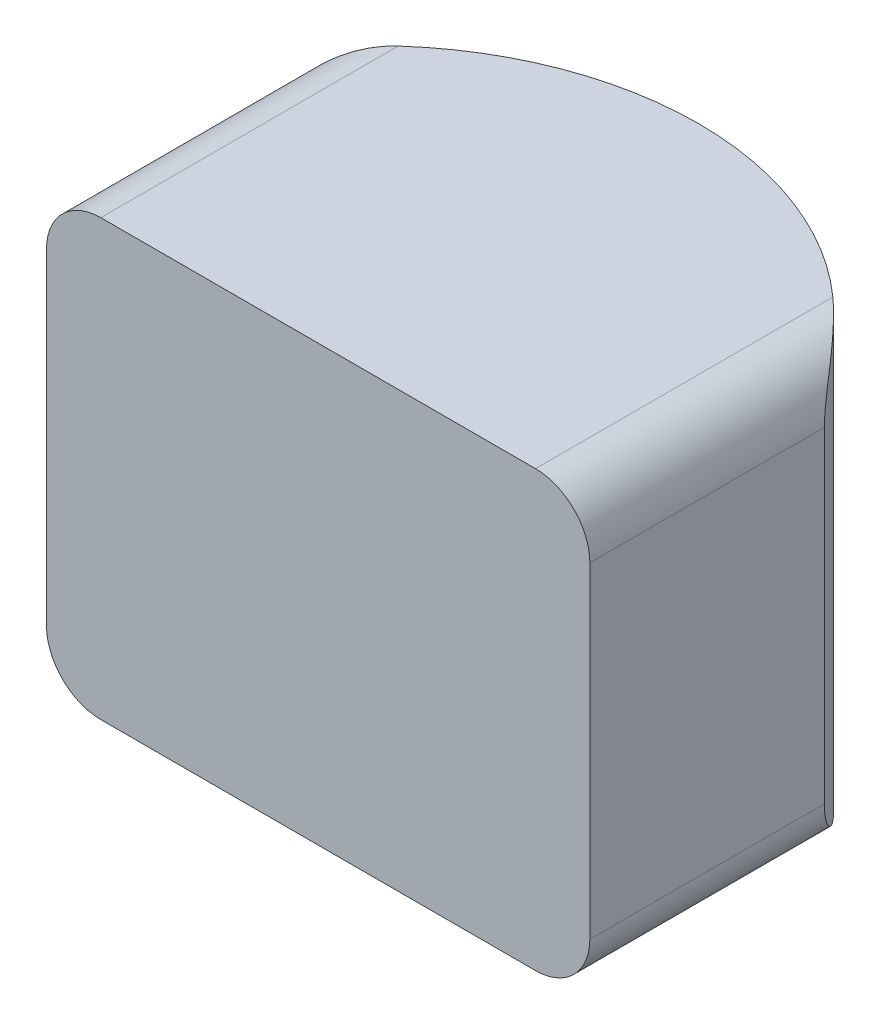
ISO-10303-21;
HEADER;
FILE_DESCRIPTION(('STEP AP214'),'2;1');
FILE_NAME('part.step','',(''),(''),'','','');
FILE_SCHEMA(('AUTOMOTIVE_DESIGN { 1 0 10303 214 1 1 1 1 }'));
ENDSEC;
DATA;
#1=APPLICATION_CONTEXT('core data for automotive mechanical design processes');
#2=APPLICATION_PROTOCOL_DEFINITION('international standard','automotive_design',2000,#1);
#3=PRODUCT_CONTEXT('',#1,'mechanical');
#4=PRODUCT('Part','Part','',(#3));
#5=PRODUCT_RELATED_PRODUCT_CATEGORY('part','',(#4));
#6=PRODUCT_DEFINITION_FORMATION('','',#4);
#7=PRODUCT_DEFINITION_CONTEXT('part definition',#1,'design');
#8=PRODUCT_DEFINITION('design','',#6,#7);
#9=PRODUCT_DEFINITION_SHAPE('','',#8);
#10=(LENGTH_UNIT() NAMED_UNIT(*) SI_UNIT(.MILLI.,.METRE.));
#11=(NAMED_UNIT(*) PLANE_ANGLE_UNIT() SI_UNIT($,.RADIAN.));
#12=(NAMED_UNIT(*) SI_UNIT($,.STERADIAN.) SOLID_ANGLE_UNIT());
#13=UNCERTAINTY_MEASURE_WITH_UNIT(LENGTH_MEASURE(1.E-05),#10,'distance_accuracy_value','');
#14=(GEOMETRIC_REPRESENTATION_CONTEXT(3) GLOBAL_UNCERTAINTY_ASSIGNED_CONTEXT((#13)) GLOBAL_UNIT_ASSIGNED_CONTEXT((#10,
#11,#12)) REPRESENTATION_CONTEXT('',''));
#15=CARTESIAN_POINT('',(0.,0.,0.));
#16=DIRECTION('',(0.,0.,1.));
#17=DIRECTION('',(1.,0.,0.));
#18=AXIS2_PLACEMENT_3D('',#15,#16,#17);
#19=CARTESIAN_POINT('',(4.,3.,-1.));
#20=DIRECTION('',(0.,0.,1.));
#21=DIRECTION('',(1.,0.,0.));
#22=AXIS2_PLACEMENT_3D('',#19,#20,#21);
#23=CYLINDRICAL_SURFACE('',#22,1.);
#24=CARTESIAN_POINT('',(4.,3.,0.));
#25=DIRECTION('',(0.,0.,1.));
#26=DIRECTION('',(-1.,0.,0.));
#27=AXIS2_PLACEMENT_3D('',#24,#25,#26);
#28=CIRCLE('',#27,1.);
#29=CARTESIAN_POINT('',(5.,2.99999999999999,0.));
#30=VERTEX_POINT('',#29);
#31=CARTESIAN_POINT('',(3.99999999999999,4.,0.));
#32=VERTEX_POINT('',#31);
#33=EDGE_CURVE('E236',#30,#32,#28,.T.);
#34=ORIENTED_EDGE('',*,*,#33,.F.);
#35=DIRECTION('',(0.,0.,1.));
#36=VECTOR('',#35,1.);
#37=CARTESIAN_POINT('',(5.,2.99999999999999,-1.));
#38=LINE('',#37,#36);
#39=CARTESIAN_POINT('',(5.,2.99999999999999,-4.31662479591225));
#40=VERTEX_POINT('',#39);
#41=EDGE_CURVE('E76',#40,#30,#38,.T.);
#42=ORIENTED_EDGE('',*,*,#41,.F.);
#43=CARTESIAN_POINT('',(3.99999999999999,4.,-5.47213597416036));
#44=CARTESIAN_POINT('',(4.03897853662187,3.99998939930265,-5.43728007247443));
#45=CARTESIAN_POINT('',(4.07747515593375,3.99772163288366,-5.40192309489688));
#46=CARTESIAN_POINT('',(4.15326103898565,3.98892398405111,-5.33048678692282));
#47=CARTESIAN_POINT('',(4.19055089667703,3.98239623288944,-5.29440782647567));
#48=CARTESIAN_POINT('',(4.26406731999918,3.96524911208241,-5.2214263474312));
#49=CARTESIAN_POINT('',(4.30028038915442,3.95459139450479,-5.18451925884733));
#50=CARTESIAN_POINT('',(4.37108071262617,3.92936037553928,-5.1105092027966));
#51=CARTESIAN_POINT('',(4.40566776632959,3.91478659248038,-5.07340621178471));
#52=CARTESIAN_POINT('',(4.50737451051804,3.86505194258381,-4.96153027574397));
#53=CARTESIAN_POINT('',(4.57184817961045,3.82401763353102,-4.88678093152144));
#54=CARTESIAN_POINT('',(4.66181793432333,3.75065411839832,-4.77752562030059));
#55=CARTESIAN_POINT('',(4.69064511891303,3.72428064380254,-4.74163842607548));
#56=CARTESIAN_POINT('',(4.74583920257688,3.66730578739845,-4.6713747270137));
#57=CARTESIAN_POINT('',(4.77220851950526,3.63670863563552,-4.63699675552281));
#58=CARTESIAN_POINT('',(4.82016122348758,3.57340229011556,-4.57316638988878));
#59=CARTESIAN_POINT('',(4.84195632293938,3.54103290735551,-4.54353833758051));
#60=CARTESIAN_POINT('',(4.88254621232647,3.47192859661895,-4.48739692691413));
#61=CARTESIAN_POINT('',(4.9013421671037,3.43519537323828,-4.46088236036682));
#62=CARTESIAN_POINT('',(4.93219866619862,3.36366669017885,-4.41672611139059));
#63=CARTESIAN_POINT('',(4.94486084622406,3.32959802194395,-4.39834224399799));
#64=CARTESIAN_POINT('',(4.96675614467246,3.2583820212921,-4.36626039107637));
#65=CARTESIAN_POINT('',(4.97600307665197,3.22124785102942,-4.35254354712373));
#66=CARTESIAN_POINT('',(4.98858682035538,3.15355298744279,-4.3337822844375));
#67=CARTESIAN_POINT('',(4.99280457266535,3.12351752495978,-4.32745348402442));
#68=CARTESIAN_POINT('',(4.9985397211296,3.06235419238754,-4.31882660628717));
#69=CARTESIAN_POINT('',(5.00003243388851,3.03121891584626,-4.31656537565711));
#70=CARTESIAN_POINT('',(5.,2.99999999999999,-4.31662479591225));
#71=B_SPLINE_CURVE_WITH_KNOTS('',3,(#43,#44,#45,#46,#47,#48,#49,#50,#51,#52,#53,#54,#55,#56,#57,
#58,#59,#60,#61,#62,#63,#64,#65,#66,#67,#68,#69,#70),.UNSPECIFIED.,.F.,.F.,(4,2,2,2,2,2,2,2,2,2,
2,2,2,4),(0.,0.156779652430063,0.313480928749503,0.471673501059475,0.629885539765111,
0.948826283264332,1.10780724125314,1.2666301183996,1.41332228273772,1.55995733369052,
1.68173930965045,1.80302317869529,1.89559187586748,1.98899497671797),.UNSPECIFIED.);
#72=CARTESIAN_POINT('',(3.99999999999999,4.,-5.47213597416036));
#73=VERTEX_POINT('',#72);
#74=EDGE_CURVE('E11',#73,#40,#71,.T.);
#75=ORIENTED_EDGE('',*,*,#74,.F.);
#76=DIRECTION('',(0.,0.,1.));
#77=VECTOR('',#76,1.);
#78=CARTESIAN_POINT('',(3.99999999999999,4.,-1.));
#79=LINE('',#78,#77);
#80=EDGE_CURVE('E68',#73,#32,#79,.T.);
#81=ORIENTED_EDGE('',*,*,#80,.T.);
#82=EDGE_LOOP('',(#34,#42,#75,#81));
#83=FACE_BOUND('',#82,.T.);
#84=ADVANCED_FACE('F47',(#83),#23,.T.);
#85=CARTESIAN_POINT('',(5.,2.99999999999999,-1.));
#86=DIRECTION('',(1.,0.,0.));
#87=DIRECTION('',(0.,1.,0.));
#88=AXIS2_PLACEMENT_3D('',#85,#86,#87);
#89=PLANE('',#88);
#90=DIRECTION('',(0.,1.,0.));
#91=VECTOR('',#90,1.);
#92=CARTESIAN_POINT('',(5.,2.99999999999999,0.));
#93=LINE('',#92,#91);
#94=CARTESIAN_POINT('',(5.,-3.,0.));
#95=VERTEX_POINT('',#94);
#96=EDGE_CURVE('E188',#95,#30,#93,.T.);
#97=ORIENTED_EDGE('',*,*,#96,.F.);
#98=DIRECTION('',(0.,0.,1.));
#99=VECTOR('',#98,1.);
#100=CARTESIAN_POINT('',(5.,-3.,-1.));
#101=LINE('',#100,#99);
#102=CARTESIAN_POINT('',(5.,-3.,-4.31662479591225));
#103=VERTEX_POINT('',#102);
#104=EDGE_CURVE('E186',#103,#95,#101,.T.);
#105=ORIENTED_EDGE('',*,*,#104,.F.);
#106=DIRECTION('',(0.,1.,0.));
#107=VECTOR('',#106,1.);
#108=CARTESIAN_POINT('',(5.,-7.,-4.31662479591225));
#109=LINE('',#108,#107);
#110=EDGE_CURVE('E61',#40,#103,#109,.F.);
#111=ORIENTED_EDGE('',*,*,#110,.F.);
#112=ORIENTED_EDGE('',*,*,#41,.T.);
#113=EDGE_LOOP('',(#97,#105,#111,#112));
#114=FACE_BOUND('',#113,.T.);
#115=ADVANCED_FACE('F185',(#114),#89,.T.);
#116=CARTESIAN_POINT('',(4.,-3.,-1.));
#117=DIRECTION('',(0.,0.,1.));
#118=DIRECTION('',(1.,0.,0.));
#119=AXIS2_PLACEMENT_3D('',#116,#117,#118);
#120=CYLINDRICAL_SURFACE('',#119,1.);
#121=CARTESIAN_POINT('',(4.,-3.,0.));
#122=DIRECTION('',(0.,0.,1.));
#123=DIRECTION('',(1.,0.,0.));
#124=AXIS2_PLACEMENT_3D('',#121,#122,#123);
#125=CIRCLE('',#124,1.);
#126=CARTESIAN_POINT('',(3.99999999999999,-4.,0.));
#127=VERTEX_POINT('',#126);
#128=EDGE_CURVE('E196',#127,#95,#125,.T.);
#129=ORIENTED_EDGE('',*,*,#128,.F.);
#130=DIRECTION('',(0.,0.,1.));
#131=VECTOR('',#130,1.);
#132=CARTESIAN_POINT('',(3.99999999999999,-4.,-1.));
#133=LINE('',#132,#131);
#134=CARTESIAN_POINT('',(3.99999999999999,-4.,-5.47213597416036));
#135=VERTEX_POINT('',#134);
#136=EDGE_CURVE('E192',#135,#127,#133,.T.);
#137=ORIENTED_EDGE('',*,*,#136,.F.);
#138=CARTESIAN_POINT('',(5.,-3.,-4.31662479591225));
#139=CARTESIAN_POINT('',(5.0000421216249,-3.03364561803897,-4.3165476263173));
#140=CARTESIAN_POINT('',(4.99830443621935,-3.067176051061,-4.31918155855792));
#141=CARTESIAN_POINT('',(4.99166925674915,-3.13283734485618,-4.32915847920145));
#142=CARTESIAN_POINT('',(4.98680731214375,-3.16497966293555,-4.33644848278611));
#143=CARTESIAN_POINT('',(4.9727109620414,-3.2354687543862,-4.35742924133836));
#144=CARTESIAN_POINT('',(4.96267674554955,-3.27330231156272,-4.37227954632283));
#145=CARTESIAN_POINT('',(4.93911666981486,-3.34571453664548,-4.40669437160448));
#146=CARTESIAN_POINT('',(4.92557412837217,-3.38027654572405,-4.42628138466691));
#147=CARTESIAN_POINT('',(4.88757938288335,-3.46404066737894,-4.48039715013376));
#148=CARTESIAN_POINT('',(4.8612183978748,-3.510869719904,-4.51722721531246));
#149=CARTESIAN_POINT('',(4.80372577031788,-3.5972642685328,-4.59535702442414));
#150=CARTESIAN_POINT('',(4.7725834501944,-3.63681306074702,-4.6366667099617));
#151=CARTESIAN_POINT('',(4.71381560441839,-3.70137188856748,-4.71237220316));
#152=CARTESIAN_POINT('',(4.68693795668153,-3.72766221442028,-4.74627386761729));
#153=CARTESIAN_POINT('',(4.63113319091879,-3.77656132308109,-4.81504549199922));
#154=CARTESIAN_POINT('',(4.60220500998042,-3.79916817620261,-4.84991594832691));
#155=CARTESIAN_POINT('',(4.51265228718628,-3.86168336573592,-4.95530442411346));
#156=CARTESIAN_POINT('',(4.44922667513776,-3.89632143863991,-5.02664241944641));
#157=CARTESIAN_POINT('',(4.32316093635318,-3.94853006430263,-5.16147801361491));
#158=CARTESIAN_POINT('',(4.26113712585061,-3.96751045051233,-5.22501262334535));
#159=CARTESIAN_POINT('',(4.16516689410654,-3.98680267981907,-5.31895661590715));
#160=CARTESIAN_POINT('',(4.13273240824828,-3.99170325576104,-5.35000492377091));
#161=CARTESIAN_POINT('',(4.06698598294165,-3.99829990084998,-5.41153711829583));
#162=CARTESIAN_POINT('',(4.03367362273109,-3.99999440393433,-5.44202072192233));
#163=CARTESIAN_POINT('',(3.99999999999999,-4.,-5.47213597416036));
#164=B_SPLINE_CURVE_WITH_KNOTS('',3,(#138,#139,#140,#141,#142,#143,#144,#145,#146,#147,#148,
#149,#150,#151,#152,#153,#154,#155,#156,#157,#158,#159,#160,#161,#162,#163),.UNSPECIFIED.,.F.,
.F.,(4,2,2,2,2,2,2,2,2,2,2,2,4),(0.,0.100603014242492,0.200081110626384,0.324977767900732,
0.450479576492776,0.644846611283564,0.839654191360514,0.991332070876693,1.14308915721602,
1.44641226408107,1.71789794643536,1.85328433638383,1.98873684113724),.UNSPECIFIED.);
#165=EDGE_CURVE('E173',#103,#135,#164,.T.);
#166=ORIENTED_EDGE('',*,*,#165,.F.);
#167=ORIENTED_EDGE('',*,*,#104,.T.);
#168=EDGE_LOOP('',(#129,#137,#166,#167));
#169=FACE_BOUND('',#168,.T.);
#170=ADVANCED_FACE('F194',(#169),#120,.T.);
#171=CARTESIAN_POINT('',(-3.99999999999999,-4.,-1.));
#172=DIRECTION('',(0.,-1.,0.));
#173=DIRECTION('',(0.,0.,-1.));
#174=AXIS2_PLACEMENT_3D('',#171,#172,#173);
#175=PLANE('',#174);
#176=DIRECTION('',(1.,0.,0.));
#177=VECTOR('',#176,1.);
#178=CARTESIAN_POINT('',(-3.99999999999999,-4.,0.));
#179=LINE('',#178,#177);
#180=CARTESIAN_POINT('',(-3.99999999999999,-4.,0.));
#181=VERTEX_POINT('',#180);
#182=EDGE_CURVE('E229',#181,#127,#179,.T.);
#183=ORIENTED_EDGE('',*,*,#182,.F.);
#184=DIRECTION('',(0.,0.,1.));
#185=VECTOR('',#184,1.);
#186=CARTESIAN_POINT('',(-3.99999999999999,-4.,-1.));
#187=LINE('',#186,#185);
#188=CARTESIAN_POINT('',(-3.99999999999999,-4.,-5.47213597416036));
#189=VERTEX_POINT('',#188);
#190=EDGE_CURVE('E201',#189,#181,#187,.T.);
#191=ORIENTED_EDGE('',*,*,#190,.F.);
#192=CARTESIAN_POINT('',(0.,-4.,-1.00000005820766));
#193=DIRECTION('',(0.,-1.,0.));
#194=DIRECTION('',(0.,0.,-1.));
#195=AXIS2_PLACEMENT_3D('',#192,#193,#194);
#196=CIRCLE('',#195,5.99999997089617);
#197=EDGE_CURVE('E169',#135,#189,#196,.F.);
#198=ORIENTED_EDGE('',*,*,#197,.F.);
#199=ORIENTED_EDGE('',*,*,#136,.T.);
#200=EDGE_LOOP('',(#183,#191,#198,#199));
#201=FACE_BOUND('',#200,.T.);
#202=ADVANCED_FACE('F203',(#201),#175,.T.);
#203=CARTESIAN_POINT('',(-4.,-3.,-1.));
#204=DIRECTION('',(0.,0.,1.));
#205=DIRECTION('',(1.,0.,0.));
#206=AXIS2_PLACEMENT_3D('',#203,#204,#205);
#207=CYLINDRICAL_SURFACE('',#206,1.);
#208=CARTESIAN_POINT('',(-4.,-3.,0.));
#209=DIRECTION('',(0.,0.,1.));
#210=DIRECTION('',(1.,0.,0.));
#211=AXIS2_PLACEMENT_3D('',#208,#209,#210);
#212=CIRCLE('',#211,1.);
#213=CARTESIAN_POINT('',(-5.,-2.99999999999999,0.));
#214=VERTEX_POINT('',#213);
#215=EDGE_CURVE('E210',#214,#181,#212,.T.);
#216=ORIENTED_EDGE('',*,*,#215,.F.);
#217=DIRECTION('',(0.,0.,1.));
#218=VECTOR('',#217,1.);
#219=CARTESIAN_POINT('',(-5.,-2.99999999999999,-1.));
#220=LINE('',#219,#218);
#221=CARTESIAN_POINT('',(-5.,-2.99999999999999,-4.31662479591225));
#222=VERTEX_POINT('',#221);
#223=EDGE_CURVE('E208',#222,#214,#220,.T.);
#224=ORIENTED_EDGE('',*,*,#223,.F.);
#225=CARTESIAN_POINT('',(-3.99999999999999,-4.,-5.47213597416036));
#226=CARTESIAN_POINT('',(-4.03897853662187,-3.99998939930265,-5.43728007247443));
#227=CARTESIAN_POINT('',(-4.07747515593375,-3.99772163288366,-5.40192309489688));
#228=CARTESIAN_POINT('',(-4.15326103898565,-3.98892398405111,-5.33048678692282));
#229=CARTESIAN_POINT('',(-4.19055089667703,-3.98239623288944,-5.29440782647567));
#230=CARTESIAN_POINT('',(-4.26406731999918,-3.96524911208241,-5.2214263474312));
#231=CARTESIAN_POINT('',(-4.30028038915442,-3.95459139450479,-5.18451925884733));
#232=CARTESIAN_POINT('',(-4.37108071262617,-3.92936037553928,-5.1105092027966));
#233=CARTESIAN_POINT('',(-4.40566776632959,-3.91478659248038,-5.07340621178471));
#234=CARTESIAN_POINT('',(-4.50737451051804,-3.86505194258381,-4.96153027574397));
#235=CARTESIAN_POINT('',(-4.57184817961045,-3.82401763353102,-4.88678093152144));
#236=CARTESIAN_POINT('',(-4.66181793432333,-3.75065411839832,-4.77752562030059));
#237=CARTESIAN_POINT('',(-4.69064511891303,-3.72428064380254,-4.74163842607548));
#238=CARTESIAN_POINT('',(-4.74583920257688,-3.66730578739845,-4.6713747270137));
#239=CARTESIAN_POINT('',(-4.77220851950526,-3.63670863563552,-4.63699675552281));
#240=CARTESIAN_POINT('',(-4.82016122348758,-3.57340229011556,-4.57316638988878));
#241=CARTESIAN_POINT('',(-4.84195632293938,-3.54103290735551,-4.54353833758051));
#242=CARTESIAN_POINT('',(-4.88254621232647,-3.47192859661895,-4.48739692691413));
#243=CARTESIAN_POINT('',(-4.9013421671037,-3.43519537323828,-4.46088236036682));
#244=CARTESIAN_POINT('',(-4.93219866619862,-3.36366669017885,-4.41672611139059));
#245=CARTESIAN_POINT('',(-4.94486084622406,-3.32959802194395,-4.39834224399799));
#246=CARTESIAN_POINT('',(-4.96675614467246,-3.2583820212921,-4.36626039107637));
#247=CARTESIAN_POINT('',(-4.97600307665197,-3.22124785102942,-4.35254354712373));
#248=CARTESIAN_POINT('',(-4.98858682035538,-3.15355298744279,-4.3337822844375));
#249=CARTESIAN_POINT('',(-4.99280457266535,-3.12351752495978,-4.32745348402442));
#250=CARTESIAN_POINT('',(-4.9985397211296,-3.06235419238754,-4.31882660628717));
#251=CARTESIAN_POINT('',(-5.00003243388851,-3.03121891584626,-4.31656537565711));
#252=CARTESIAN_POINT('',(-5.,-2.99999999999999,-4.31662479591225));
#253=B_SPLINE_CURVE_WITH_KNOTS('',3,(#225,#226,#227,#228,#229,#230,#231,#232,#233,#234,#235,
#236,#237,#238,#239,#240,#241,#242,#243,#244,#245,#246,#247,#248,#249,#250,#251,#252),
.UNSPECIFIED.,.F.,.F.,(4,2,2,2,2,2,2,2,2,2,2,2,2,4),(0.,0.156779652430063,0.313480928749503,
0.471673501059475,0.629885539765111,0.948826283264332,1.10780724125314,1.2666301183996,
1.41332228273772,1.55995733369052,1.68173930965045,1.80302317869529,1.89559187586748,
1.98899497671797),.UNSPECIFIED.);
#254=EDGE_CURVE('E146',#189,#222,#253,.T.);
#255=ORIENTED_EDGE('',*,*,#254,.F.);
#256=ORIENTED_EDGE('',*,*,#190,.T.);
#257=EDGE_LOOP('',(#216,#224,#255,#256));
#258=FACE_BOUND('',#257,.T.);
#259=ADVANCED_FACE('F207',(#258),#207,.T.);
#260=CARTESIAN_POINT('',(-5.,2.99999999999999,-1.));
#261=DIRECTION('',(-1.,0.,0.));
#262=DIRECTION('',(0.,0.,1.));
#263=AXIS2_PLACEMENT_3D('',#260,#261,#262);
#264=PLANE('',#263);
#265=DIRECTION('',(0.,-1.,0.));
#266=VECTOR('',#265,1.);
#267=CARTESIAN_POINT('',(-5.,2.99999999999999,0.));
#268=LINE('',#267,#266);
#269=CARTESIAN_POINT('',(-5.,2.99999999999999,0.));
#270=VERTEX_POINT('',#269);
#271=EDGE_CURVE('E216',#270,#214,#268,.T.);
#272=ORIENTED_EDGE('',*,*,#271,.F.);
#273=DIRECTION('',(0.,0.,1.));
#274=VECTOR('',#273,1.);
#275=CARTESIAN_POINT('',(-5.,2.99999999999999,-1.));
#276=LINE('',#275,#274);
#277=CARTESIAN_POINT('',(-5.,2.99999999999999,-4.31662479591225));
#278=VERTEX_POINT('',#277);
#279=EDGE_CURVE('E129',#278,#270,#276,.T.);
#280=ORIENTED_EDGE('',*,*,#279,.F.);
#281=DIRECTION('',(0.,1.,0.));
#282=VECTOR('',#281,1.);
#283=CARTESIAN_POINT('',(-5.,-7.,-4.31662479591225));
#284=LINE('',#283,#282);
#285=EDGE_CURVE('E140',#222,#278,#284,.T.);
#286=ORIENTED_EDGE('',*,*,#285,.F.);
#287=ORIENTED_EDGE('',*,*,#223,.T.);
#288=EDGE_LOOP('',(#272,#280,#286,#287));
#289=FACE_BOUND('',#288,.T.);
#290=ADVANCED_FACE('F215',(#289),#264,.T.);
#291=CARTESIAN_POINT('',(-4.,3.,-1.));
#292=DIRECTION('',(0.,0.,1.));
#293=DIRECTION('',(1.,0.,0.));
#294=AXIS2_PLACEMENT_3D('',#291,#292,#293);
#295=CYLINDRICAL_SURFACE('',#294,1.);
#296=CARTESIAN_POINT('',(-4.,3.,0.));
#297=DIRECTION('',(0.,0.,1.));
#298=DIRECTION('',(1.,0.,0.));
#299=AXIS2_PLACEMENT_3D('',#296,#297,#298);
#300=CIRCLE('',#299,1.);
#301=CARTESIAN_POINT('',(-3.99999999999999,4.,0.));
#302=VERTEX_POINT('',#301);
#303=EDGE_CURVE('E126',#302,#270,#300,.T.);
#304=ORIENTED_EDGE('',*,*,#303,.F.);
#305=DIRECTION('',(0.,0.,1.));
#306=VECTOR('',#305,1.);
#307=CARTESIAN_POINT('',(-3.99999999999999,4.,-1.));
#308=LINE('',#307,#306);
#309=CARTESIAN_POINT('',(-3.99999999999999,4.,-5.47213597416036));
#310=VERTEX_POINT('',#309);
#311=EDGE_CURVE('E120',#310,#302,#308,.T.);
#312=ORIENTED_EDGE('',*,*,#311,.F.);
#313=CARTESIAN_POINT('',(-5.,2.99999999999999,-4.31662479591225));
#314=CARTESIAN_POINT('',(-5.0000421216249,3.03364561803897,-4.3165476263173));
#315=CARTESIAN_POINT('',(-4.99830443621935,3.067176051061,-4.31918155855792));
#316=CARTESIAN_POINT('',(-4.99166925674915,3.13283734485617,-4.32915847920145));
#317=CARTESIAN_POINT('',(-4.98680731214376,3.16497966293554,-4.33644848278611));
#318=CARTESIAN_POINT('',(-4.9727109620414,3.23546875438619,-4.35742924133836));
#319=CARTESIAN_POINT('',(-4.96267674554955,3.27330231156271,-4.37227954632283));
#320=CARTESIAN_POINT('',(-4.93911666981486,3.34571453664547,-4.40669437160448));
#321=CARTESIAN_POINT('',(-4.92557412837218,3.38027654572405,-4.42628138466691));
#322=CARTESIAN_POINT('',(-4.88757938288336,3.46404066737893,-4.48039715013376));
#323=CARTESIAN_POINT('',(-4.86121839787481,3.51086971990399,-4.51722721531245));
#324=CARTESIAN_POINT('',(-4.80372577031789,3.59726426853279,-4.59535702442413));
#325=CARTESIAN_POINT('',(-4.7725834501944,3.63681306074701,-4.63666670996169));
#326=CARTESIAN_POINT('',(-4.7138156044184,3.70137188856747,-4.71237220315999));
#327=CARTESIAN_POINT('',(-4.68693795668153,3.72766221442027,-4.74627386761728));
#328=CARTESIAN_POINT('',(-4.6311331909188,3.77656132308108,-4.8150454919992));
#329=CARTESIAN_POINT('',(-4.60220500998043,3.79916817620261,-4.8499159483269));
#330=CARTESIAN_POINT('',(-4.5126522871863,3.86168336573591,-4.95530442411345));
#331=CARTESIAN_POINT('',(-4.44922667513777,3.89632143863991,-5.02664241944639));
#332=CARTESIAN_POINT('',(-4.32316093635319,3.94853006430263,-5.1614780136149));
#333=CARTESIAN_POINT('',(-4.26113712585061,3.96751045051233,-5.22501262334534));
#334=CARTESIAN_POINT('',(-4.16516689410655,3.98680267981906,-5.31895661590714));
#335=CARTESIAN_POINT('',(-4.13273240824829,3.99170325576104,-5.3500049237709));
#336=CARTESIAN_POINT('',(-4.06698598294166,3.99829990084998,-5.41153711829582));
#337=CARTESIAN_POINT('',(-4.03367362273109,3.99999440393433,-5.44202072192232));
#338=CARTESIAN_POINT('',(-3.99999999999999,4.,-5.47213597416036));
#339=B_SPLINE_CURVE_WITH_KNOTS('',3,(#313,#314,#315,#316,#317,#318,#319,#320,#321,#322,#323,
#324,#325,#326,#327,#328,#329,#330,#331,#332,#333,#334,#335,#336,#337,#338),.UNSPECIFIED.,.F.,
.F.,(4,2,2,2,2,2,2,2,2,2,2,2,4),(0.,0.100603014242491,0.200081110626383,0.324977767900728,
0.450479576492772,0.644846611283557,0.839654191360504,0.99133207087668,1.143089157216,
1.44641226408105,1.71789794643535,1.85328433638382,1.98873684113724),.UNSPECIFIED.);
#340=EDGE_CURVE('E123',#278,#310,#339,.T.);
#341=ORIENTED_EDGE('',*,*,#340,.F.);
#342=ORIENTED_EDGE('',*,*,#279,.T.);
#343=EDGE_LOOP('',(#304,#312,#341,#342));
#344=FACE_BOUND('',#343,.T.);
#345=ADVANCED_FACE('F121',(#344),#295,.T.);
#346=CARTESIAN_POINT('',(-3.99999999999999,4.,-1.));
#347=DIRECTION('',(0.,1.,0.));
#348=DIRECTION('',(0.,0.,1.));
#349=AXIS2_PLACEMENT_3D('',#346,#347,#348);
#350=PLANE('',#349);
#351=DIRECTION('',(-1.,0.,0.));
#352=VECTOR('',#351,1.);
#353=CARTESIAN_POINT('',(-3.99999999999999,4.,0.));
#354=LINE('',#353,#352);
#355=EDGE_CURVE('E237',#32,#302,#354,.T.);
#356=ORIENTED_EDGE('',*,*,#355,.F.);
#357=ORIENTED_EDGE('',*,*,#80,.F.);
#358=CARTESIAN_POINT('',(0.,4.,-1.00000005820766));
#359=DIRECTION('',(0.,1.,0.));
#360=DIRECTION('',(0.,0.,1.));
#361=AXIS2_PLACEMENT_3D('',#358,#359,#360);
#362=CIRCLE('',#361,5.99999997089617);
#363=EDGE_CURVE('E132',#310,#73,#362,.F.);
#364=ORIENTED_EDGE('',*,*,#363,.F.);
#365=ORIENTED_EDGE('',*,*,#311,.T.);
#366=EDGE_LOOP('',(#356,#357,#364,#365));
#367=FACE_BOUND('',#366,.T.);
#368=ADVANCED_FACE('F133',(#367),#350,.T.);
#369=CARTESIAN_POINT('',(4.,3.,0.));
#370=DIRECTION('',(0.,0.,-1.));
#371=DIRECTION('',(-1.,0.,0.));
#372=AXIS2_PLACEMENT_3D('',#369,#370,#371);
#373=PLANE('',#372);
#374=ORIENTED_EDGE('',*,*,#33,.T.);
#375=ORIENTED_EDGE('',*,*,#355,.T.);
#376=ORIENTED_EDGE('',*,*,#303,.T.);
#377=ORIENTED_EDGE('',*,*,#271,.T.);
#378=ORIENTED_EDGE('',*,*,#215,.T.);
#379=ORIENTED_EDGE('',*,*,#182,.T.);
#380=ORIENTED_EDGE('',*,*,#128,.T.);
#381=ORIENTED_EDGE('',*,*,#96,.T.);
#382=EDGE_LOOP('',(#374,#375,#376,#377,#378,#379,#380,#381));
#383=FACE_BOUND('',#382,.T.);
#384=ADVANCED_FACE('F244',(#383),#373,.F.);
#385=CARTESIAN_POINT('',(0.,-7.,-1.00000005820766));
#386=DIRECTION('',(0.,1.,0.));
#387=DIRECTION('',(0.,0.,1.));
#388=AXIS2_PLACEMENT_3D('',#385,#386,#387);
#389=CYLINDRICAL_SURFACE('',#388,5.99999997089617);
#390=ORIENTED_EDGE('',*,*,#363,.T.);
#391=ORIENTED_EDGE('',*,*,#74,.T.);
#392=ORIENTED_EDGE('',*,*,#110,.T.);
#393=ORIENTED_EDGE('',*,*,#165,.T.);
#394=ORIENTED_EDGE('',*,*,#197,.T.);
#395=ORIENTED_EDGE('',*,*,#254,.T.);
#396=ORIENTED_EDGE('',*,*,#285,.T.);
#397=ORIENTED_EDGE('',*,*,#340,.T.);
#398=EDGE_LOOP('',(#390,#391,#392,#393,#394,#395,#396,#397));
#399=FACE_BOUND('',#398,.T.);
#400=ADVANCED_FACE('F137',(#399),#389,.T.);
#401=CLOSED_SHELL('',(#84,#115,#170,#202,#259,#290,#345,#368,#384,#400));
#402=MANIFOLD_SOLID_BREP('B2',#401);
#403=ADVANCED_BREP_SHAPE_REPRESENTATION('',(#18,#402),#14);
#404=SHAPE_DEFINITION_REPRESENTATION(#9,#403);
ENDSEC;
END-ISO-10303-21;
